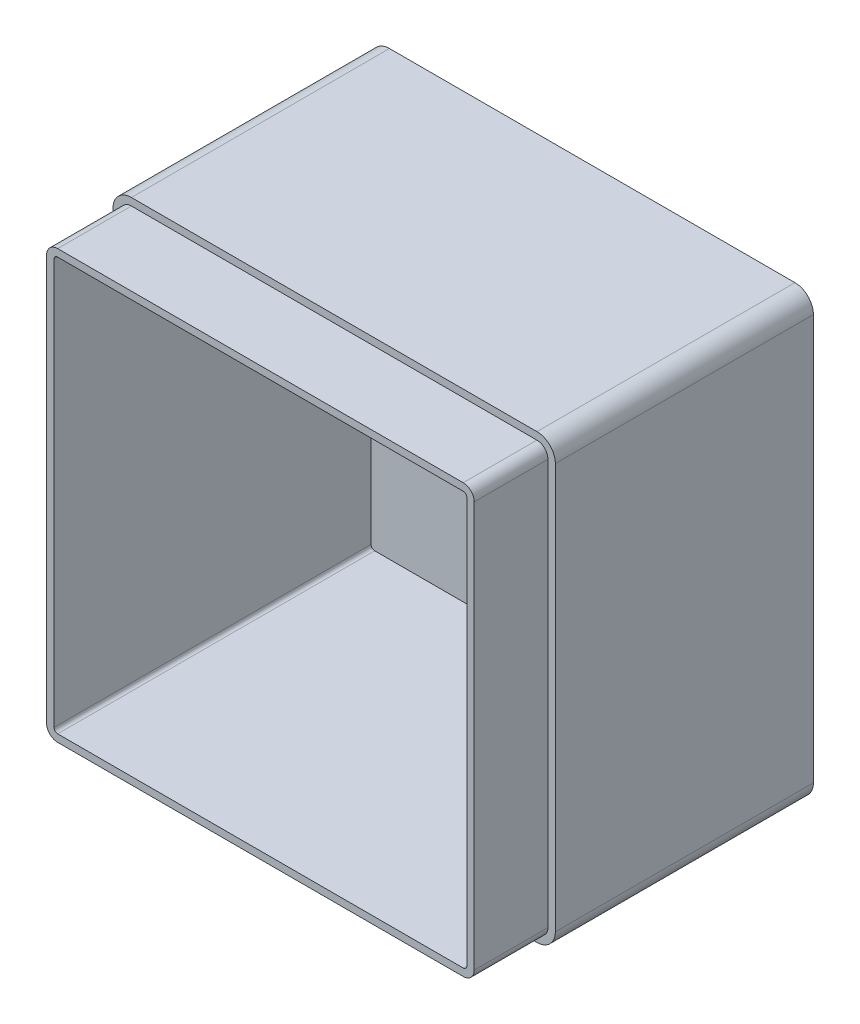
ISO-10303-21;
HEADER;
FILE_DESCRIPTION(('STEP AP214'),'2;1');
FILE_NAME('part.step','',(''),(''),'','','');
FILE_SCHEMA(('AUTOMOTIVE_DESIGN { 1 0 10303 214 1 1 1 1 }'));
ENDSEC;
DATA;
#1=APPLICATION_CONTEXT('core data for automotive mechanical design processes');
#2=APPLICATION_PROTOCOL_DEFINITION('international standard','automotive_design',2000,#1);
#3=PRODUCT_CONTEXT('',#1,'mechanical');
#4=PRODUCT('Part','Part','',(#3));
#5=PRODUCT_RELATED_PRODUCT_CATEGORY('part','',(#4));
#6=PRODUCT_DEFINITION_FORMATION('','',#4);
#7=PRODUCT_DEFINITION_CONTEXT('part definition',#1,'design');
#8=PRODUCT_DEFINITION('design','',#6,#7);
#9=PRODUCT_DEFINITION_SHAPE('','',#8);
#10=(LENGTH_UNIT() NAMED_UNIT(*) SI_UNIT(.MILLI.,.METRE.));
#11=(NAMED_UNIT(*) PLANE_ANGLE_UNIT() SI_UNIT($,.RADIAN.));
#12=(NAMED_UNIT(*) SI_UNIT($,.STERADIAN.) SOLID_ANGLE_UNIT());
#13=UNCERTAINTY_MEASURE_WITH_UNIT(LENGTH_MEASURE(1.E-05),#10,'distance_accuracy_value','');
#14=(GEOMETRIC_REPRESENTATION_CONTEXT(3) GLOBAL_UNCERTAINTY_ASSIGNED_CONTEXT((#13)) GLOBAL_UNIT_ASSIGNED_CONTEXT((#10,
#11,#12)) REPRESENTATION_CONTEXT('',''));
#15=CARTESIAN_POINT('',(0.,0.,0.));
#16=DIRECTION('',(0.,0.,1.));
#17=DIRECTION('',(1.,0.,0.));
#18=AXIS2_PLACEMENT_3D('',#15,#16,#17);
#19=CARTESIAN_POINT('',(0.,0.,90.));
#20=DIRECTION('',(0.,0.,-1.));
#21=DIRECTION('',(-1.,0.,0.));
#22=AXIS2_PLACEMENT_3D('',#19,#20,#21);
#23=PLANE('',#22);
#24=DIRECTION('',(0.,1.,0.));
#25=VECTOR('',#24,1.);
#26=CARTESIAN_POINT('',(116.,0.,90.));
#27=LINE('',#26,#25);
#28=CARTESIAN_POINT('',(116.,5.,90.));
#29=VERTEX_POINT('',#28);
#30=CARTESIAN_POINT('',(116.,115.,90.));
#31=VERTEX_POINT('',#30);
#32=EDGE_CURVE('E392',#29,#31,#27,.T.);
#33=ORIENTED_EDGE('',*,*,#32,.F.);
#34=CARTESIAN_POINT('',(115.,5.,90.));
#35=DIRECTION('',(0.,0.,-1.));
#36=DIRECTION('',(-1.,0.,0.));
#37=AXIS2_PLACEMENT_3D('',#34,#35,#36);
#38=CIRCLE('',#37,1.);
#39=CARTESIAN_POINT('',(115.,4.,90.));
#40=VERTEX_POINT('',#39);
#41=EDGE_CURVE('E389',#40,#29,#38,.F.);
#42=ORIENTED_EDGE('',*,*,#41,.F.);
#43=DIRECTION('',(1.,0.,0.));
#44=VECTOR('',#43,1.);
#45=CARTESIAN_POINT('',(0.,4.,90.));
#46=LINE('',#45,#44);
#47=CARTESIAN_POINT('',(4.99999999999999,4.,90.));
#48=VERTEX_POINT('',#47);
#49=EDGE_CURVE('E386',#48,#40,#46,.T.);
#50=ORIENTED_EDGE('',*,*,#49,.F.);
#51=CARTESIAN_POINT('',(5.,5.,90.));
#52=DIRECTION('',(0.,0.,-1.));
#53=DIRECTION('',(-1.,0.,0.));
#54=AXIS2_PLACEMENT_3D('',#51,#52,#53);
#55=CIRCLE('',#54,1.);
#56=CARTESIAN_POINT('',(4.,5.,90.));
#57=VERTEX_POINT('',#56);
#58=EDGE_CURVE('E375',#57,#48,#55,.F.);
#59=ORIENTED_EDGE('',*,*,#58,.F.);
#60=DIRECTION('',(0.,-1.,0.));
#61=VECTOR('',#60,1.);
#62=CARTESIAN_POINT('',(4.,0.,90.));
#63=LINE('',#62,#61);
#64=CARTESIAN_POINT('',(3.99999999999996,115.,90.));
#65=VERTEX_POINT('',#64);
#66=EDGE_CURVE('E339',#65,#57,#63,.T.);
#67=ORIENTED_EDGE('',*,*,#66,.F.);
#68=CARTESIAN_POINT('',(4.99999999999996,115.,90.));
#69=DIRECTION('',(0.,0.,-1.));
#70=DIRECTION('',(-1.,0.,0.));
#71=AXIS2_PLACEMENT_3D('',#68,#69,#70);
#72=CIRCLE('',#71,1.);
#73=CARTESIAN_POINT('',(4.99999999999996,116.,90.));
#74=VERTEX_POINT('',#73);
#75=EDGE_CURVE('E395',#74,#65,#72,.F.);
#76=ORIENTED_EDGE('',*,*,#75,.F.);
#77=DIRECTION('',(-1.,0.,0.));
#78=VECTOR('',#77,1.);
#79=CARTESIAN_POINT('',(0.,116.,90.));
#80=LINE('',#79,#78);
#81=CARTESIAN_POINT('',(115.,116.,90.));
#82=VERTEX_POINT('',#81);
#83=EDGE_CURVE('E382',#82,#74,#80,.T.);
#84=ORIENTED_EDGE('',*,*,#83,.F.);
#85=CARTESIAN_POINT('',(115.,115.,90.));
#86=DIRECTION('',(0.,0.,-1.));
#87=DIRECTION('',(-1.,0.,0.));
#88=AXIS2_PLACEMENT_3D('',#85,#86,#87);
#89=CIRCLE('',#88,1.);
#90=EDGE_CURVE('E334',#31,#82,#89,.F.);
#91=ORIENTED_EDGE('',*,*,#90,.F.);
#92=EDGE_LOOP('',(#33,#42,#50,#59,#67,#76,#84,#91));
#93=FACE_BOUND('',#92,.T.);
#94=CARTESIAN_POINT('',(115.,5.,90.));
#95=DIRECTION('',(0.,0.,1.));
#96=DIRECTION('',(1.,0.,0.));
#97=AXIS2_PLACEMENT_3D('',#94,#95,#96);
#98=CIRCLE('',#97,3.);
#99=CARTESIAN_POINT('',(115.,2.,90.));
#100=VERTEX_POINT('',#99);
#101=CARTESIAN_POINT('',(118.,5.,90.));
#102=VERTEX_POINT('',#101);
#103=EDGE_CURVE('E257',#100,#102,#98,.T.);
#104=ORIENTED_EDGE('',*,*,#103,.T.);
#105=DIRECTION('',(0.,1.,0.));
#106=VECTOR('',#105,1.);
#107=CARTESIAN_POINT('',(118.,5.,90.));
#108=LINE('',#107,#106);
#109=CARTESIAN_POINT('',(118.,115.,90.));
#110=VERTEX_POINT('',#109);
#111=EDGE_CURVE('E207',#102,#110,#108,.T.);
#112=ORIENTED_EDGE('',*,*,#111,.T.);
#113=CARTESIAN_POINT('',(115.,115.,90.));
#114=DIRECTION('',(0.,0.,1.));
#115=DIRECTION('',(1.,0.,0.));
#116=AXIS2_PLACEMENT_3D('',#113,#114,#115);
#117=CIRCLE('',#116,3.);
#118=CARTESIAN_POINT('',(115.,118.,90.));
#119=VERTEX_POINT('',#118);
#120=EDGE_CURVE('E55',#110,#119,#117,.T.);
#121=ORIENTED_EDGE('',*,*,#120,.T.);
#122=DIRECTION('',(-1.,0.,0.));
#123=VECTOR('',#122,1.);
#124=CARTESIAN_POINT('',(115.,118.,90.));
#125=LINE('',#124,#123);
#126=CARTESIAN_POINT('',(4.99999999999996,118.,90.));
#127=VERTEX_POINT('',#126);
#128=EDGE_CURVE('E264',#119,#127,#125,.T.);
#129=ORIENTED_EDGE('',*,*,#128,.T.);
#130=CARTESIAN_POINT('',(4.99999999999996,115.,90.));
#131=DIRECTION('',(0.,0.,1.));
#132=DIRECTION('',(1.,0.,0.));
#133=AXIS2_PLACEMENT_3D('',#130,#131,#132);
#134=CIRCLE('',#133,3.);
#135=CARTESIAN_POINT('',(1.99999999999996,115.,90.));
#136=VERTEX_POINT('',#135);
#137=EDGE_CURVE('E268',#127,#136,#134,.T.);
#138=ORIENTED_EDGE('',*,*,#137,.T.);
#139=DIRECTION('',(0.,-1.,0.));
#140=VECTOR('',#139,1.);
#141=CARTESIAN_POINT('',(1.99999999999996,115.,90.));
#142=LINE('',#141,#140);
#143=CARTESIAN_POINT('',(2.,5.,90.));
#144=VERTEX_POINT('',#143);
#145=EDGE_CURVE('E272',#136,#144,#142,.T.);
#146=ORIENTED_EDGE('',*,*,#145,.T.);
#147=CARTESIAN_POINT('',(5.,5.,90.));
#148=DIRECTION('',(0.,0.,1.));
#149=DIRECTION('',(1.,0.,0.));
#150=AXIS2_PLACEMENT_3D('',#147,#148,#149);
#151=CIRCLE('',#150,3.);
#152=CARTESIAN_POINT('',(5.,2.,90.));
#153=VERTEX_POINT('',#152);
#154=EDGE_CURVE('E234',#144,#153,#151,.T.);
#155=ORIENTED_EDGE('',*,*,#154,.T.);
#156=DIRECTION('',(1.,0.,0.));
#157=VECTOR('',#156,1.);
#158=CARTESIAN_POINT('',(5.,2.,90.));
#159=LINE('',#158,#157);
#160=EDGE_CURVE('E230',#153,#100,#159,.T.);
#161=ORIENTED_EDGE('',*,*,#160,.T.);
#162=EDGE_LOOP('',(#104,#112,#121,#129,#138,#146,#155,#161));
#163=FACE_BOUND('',#162,.T.);
#164=ADVANCED_FACE('F39',(#93,#163),#23,.F.);
#165=CARTESIAN_POINT('',(4.,0.,90.));
#166=DIRECTION('',(1.,0.,0.));
#167=DIRECTION('',(0.,1.,0.));
#168=AXIS2_PLACEMENT_3D('',#165,#166,#167);
#169=PLANE('',#168);
#170=ORIENTED_EDGE('',*,*,#66,.T.);
#171=DIRECTION('',(0.,0.,1.));
#172=VECTOR('',#171,1.);
#173=CARTESIAN_POINT('',(4.,5.,90.));
#174=LINE('',#173,#172);
#175=CARTESIAN_POINT('',(4.,5.,4.));
#176=VERTEX_POINT('',#175);
#177=EDGE_CURVE('E327',#176,#57,#174,.T.);
#178=ORIENTED_EDGE('',*,*,#177,.F.);
#179=DIRECTION('',(0.,-1.,0.));
#180=VECTOR('',#179,1.);
#181=CARTESIAN_POINT('',(4.,0.,4.));
#182=LINE('',#181,#180);
#183=CARTESIAN_POINT('',(3.99999999999996,115.,4.));
#184=VERTEX_POINT('',#183);
#185=EDGE_CURVE('E321',#184,#176,#182,.T.);
#186=ORIENTED_EDGE('',*,*,#185,.F.);
#187=DIRECTION('',(0.,0.,1.));
#188=VECTOR('',#187,1.);
#189=CARTESIAN_POINT('',(3.99999999999996,115.,90.));
#190=LINE('',#189,#188);
#191=EDGE_CURVE('E322',#65,#184,#190,.F.);
#192=ORIENTED_EDGE('',*,*,#191,.F.);
#193=EDGE_LOOP('',(#170,#178,#186,#192));
#194=FACE_BOUND('',#193,.T.);
#195=ADVANCED_FACE('F501',(#194),#169,.T.);
#196=CARTESIAN_POINT('',(0.,4.,90.));
#197=DIRECTION('',(0.,1.,0.));
#198=DIRECTION('',(0.,0.,1.));
#199=AXIS2_PLACEMENT_3D('',#196,#197,#198);
#200=PLANE('',#199);
#201=DIRECTION('',(1.,0.,0.));
#202=VECTOR('',#201,1.);
#203=CARTESIAN_POINT('',(0.,4.,4.));
#204=LINE('',#203,#202);
#205=CARTESIAN_POINT('',(4.99999999999999,4.,4.));
#206=VERTEX_POINT('',#205);
#207=CARTESIAN_POINT('',(115.,4.,4.));
#208=VERTEX_POINT('',#207);
#209=EDGE_CURVE('E331',#206,#208,#204,.T.);
#210=ORIENTED_EDGE('',*,*,#209,.F.);
#211=DIRECTION('',(0.,0.,1.));
#212=VECTOR('',#211,1.);
#213=CARTESIAN_POINT('',(4.99999999999999,4.,90.));
#214=LINE('',#213,#212);
#215=EDGE_CURVE('E326',#48,#206,#214,.F.);
#216=ORIENTED_EDGE('',*,*,#215,.F.);
#217=ORIENTED_EDGE('',*,*,#49,.T.);
#218=DIRECTION('',(0.,0.,1.));
#219=VECTOR('',#218,1.);
#220=CARTESIAN_POINT('',(115.,4.,90.));
#221=LINE('',#220,#219);
#222=EDGE_CURVE('E361',#208,#40,#221,.T.);
#223=ORIENTED_EDGE('',*,*,#222,.F.);
#224=EDGE_LOOP('',(#210,#216,#217,#223));
#225=FACE_BOUND('',#224,.T.);
#226=ADVANCED_FACE('F507',(#225),#200,.T.);
#227=CARTESIAN_POINT('',(116.,0.,90.));
#228=DIRECTION('',(-1.,0.,0.));
#229=DIRECTION('',(0.,-1.,0.));
#230=AXIS2_PLACEMENT_3D('',#227,#228,#229);
#231=PLANE('',#230);
#232=DIRECTION('',(0.,1.,0.));
#233=VECTOR('',#232,1.);
#234=CARTESIAN_POINT('',(116.,0.,4.));
#235=LINE('',#234,#233);
#236=CARTESIAN_POINT('',(116.,5.,4.));
#237=VERTEX_POINT('',#236);
#238=CARTESIAN_POINT('',(116.,115.,4.));
#239=VERTEX_POINT('',#238);
#240=EDGE_CURVE('E340',#237,#239,#235,.T.);
#241=ORIENTED_EDGE('',*,*,#240,.F.);
#242=DIRECTION('',(0.,0.,1.));
#243=VECTOR('',#242,1.);
#244=CARTESIAN_POINT('',(116.,5.,90.));
#245=LINE('',#244,#243);
#246=EDGE_CURVE('E344',#29,#237,#245,.F.);
#247=ORIENTED_EDGE('',*,*,#246,.F.);
#248=ORIENTED_EDGE('',*,*,#32,.T.);
#249=DIRECTION('',(0.,0.,1.));
#250=VECTOR('',#249,1.);
#251=CARTESIAN_POINT('',(116.,115.,90.));
#252=LINE('',#251,#250);
#253=EDGE_CURVE('E372',#239,#31,#252,.T.);
#254=ORIENTED_EDGE('',*,*,#253,.F.);
#255=EDGE_LOOP('',(#241,#247,#248,#254));
#256=FACE_BOUND('',#255,.T.);
#257=ADVANCED_FACE('F704',(#256),#231,.T.);
#258=CARTESIAN_POINT('',(0.,116.,90.));
#259=DIRECTION('',(0.,-1.,0.));
#260=DIRECTION('',(0.,0.,-1.));
#261=AXIS2_PLACEMENT_3D('',#258,#259,#260);
#262=PLANE('',#261);
#263=ORIENTED_EDGE('',*,*,#83,.T.);
#264=DIRECTION('',(0.,0.,-1.));
#265=VECTOR('',#264,1.);
#266=CARTESIAN_POINT('',(4.99999999999996,116.,90.));
#267=LINE('',#266,#265);
#268=CARTESIAN_POINT('',(4.99999999999996,116.,4.));
#269=VERTEX_POINT('',#268);
#270=EDGE_CURVE('E379',#269,#74,#267,.F.);
#271=ORIENTED_EDGE('',*,*,#270,.F.);
#272=DIRECTION('',(-1.,0.,0.));
#273=VECTOR('',#272,1.);
#274=CARTESIAN_POINT('',(0.,116.,4.));
#275=LINE('',#274,#273);
#276=CARTESIAN_POINT('',(115.,116.,4.));
#277=VERTEX_POINT('',#276);
#278=EDGE_CURVE('E335',#277,#269,#275,.T.);
#279=ORIENTED_EDGE('',*,*,#278,.F.);
#280=DIRECTION('',(0.,0.,-1.));
#281=VECTOR('',#280,1.);
#282=CARTESIAN_POINT('',(115.,116.,90.));
#283=LINE('',#282,#281);
#284=EDGE_CURVE('E358',#82,#277,#283,.T.);
#285=ORIENTED_EDGE('',*,*,#284,.F.);
#286=EDGE_LOOP('',(#263,#271,#279,#285));
#287=FACE_BOUND('',#286,.T.);
#288=ADVANCED_FACE('F694',(#287),#262,.T.);
#289=CARTESIAN_POINT('',(0.,0.,4.));
#290=DIRECTION('',(0.,0.,-1.));
#291=DIRECTION('',(-1.,0.,0.));
#292=AXIS2_PLACEMENT_3D('',#289,#290,#291);
#293=PLANE('',#292);
#294=ORIENTED_EDGE('',*,*,#278,.T.);
#295=CARTESIAN_POINT('',(4.99999999999996,115.,4.));
#296=DIRECTION('',(0.,0.,-1.));
#297=DIRECTION('',(-1.,0.,0.));
#298=AXIS2_PLACEMENT_3D('',#295,#296,#297);
#299=CIRCLE('',#298,1.);
#300=EDGE_CURVE('E345',#184,#269,#299,.T.);
#301=ORIENTED_EDGE('',*,*,#300,.F.);
#302=ORIENTED_EDGE('',*,*,#185,.T.);
#303=CARTESIAN_POINT('',(5.,5.,4.));
#304=DIRECTION('',(0.,0.,-1.));
#305=DIRECTION('',(-1.,0.,0.));
#306=AXIS2_PLACEMENT_3D('',#303,#304,#305);
#307=CIRCLE('',#306,1.);
#308=EDGE_CURVE('E352',#206,#176,#307,.T.);
#309=ORIENTED_EDGE('',*,*,#308,.F.);
#310=ORIENTED_EDGE('',*,*,#209,.T.);
#311=CARTESIAN_POINT('',(115.,5.,4.));
#312=DIRECTION('',(0.,0.,-1.));
#313=DIRECTION('',(-1.,0.,0.));
#314=AXIS2_PLACEMENT_3D('',#311,#312,#313);
#315=CIRCLE('',#314,1.);
#316=EDGE_CURVE('E349',#237,#208,#315,.T.);
#317=ORIENTED_EDGE('',*,*,#316,.F.);
#318=ORIENTED_EDGE('',*,*,#240,.T.);
#319=CARTESIAN_POINT('',(115.,115.,4.));
#320=DIRECTION('',(0.,0.,-1.));
#321=DIRECTION('',(-1.,0.,0.));
#322=AXIS2_PLACEMENT_3D('',#319,#320,#321);
#323=CIRCLE('',#322,1.);
#324=EDGE_CURVE('E341',#277,#239,#323,.T.);
#325=ORIENTED_EDGE('',*,*,#324,.F.);
#326=EDGE_LOOP('',(#294,#301,#302,#309,#310,#317,#318,#325));
#327=FACE_BOUND('',#326,.T.);
#328=ADVANCED_FACE('F684',(#327),#293,.F.);
#329=CARTESIAN_POINT('',(115.,115.,90.));
#330=DIRECTION('',(0.,0.,-1.));
#331=DIRECTION('',(-1.,0.,0.));
#332=AXIS2_PLACEMENT_3D('',#329,#330,#331);
#333=CYLINDRICAL_SURFACE('',#332,1.);
#334=ORIENTED_EDGE('',*,*,#90,.T.);
#335=ORIENTED_EDGE('',*,*,#284,.T.);
#336=ORIENTED_EDGE('',*,*,#324,.T.);
#337=ORIENTED_EDGE('',*,*,#253,.T.);
#338=EDGE_LOOP('',(#334,#335,#336,#337));
#339=FACE_BOUND('',#338,.T.);
#340=ADVANCED_FACE('F674',(#339),#333,.F.);
#341=CARTESIAN_POINT('',(4.99999999999996,115.,90.));
#342=DIRECTION('',(0.,0.,-1.));
#343=DIRECTION('',(-1.,0.,0.));
#344=AXIS2_PLACEMENT_3D('',#341,#342,#343);
#345=CYLINDRICAL_SURFACE('',#344,1.);
#346=ORIENTED_EDGE('',*,*,#75,.T.);
#347=ORIENTED_EDGE('',*,*,#191,.T.);
#348=ORIENTED_EDGE('',*,*,#300,.T.);
#349=ORIENTED_EDGE('',*,*,#270,.T.);
#350=EDGE_LOOP('',(#346,#347,#348,#349));
#351=FACE_BOUND('',#350,.T.);
#352=ADVANCED_FACE('F665',(#351),#345,.F.);
#353=CARTESIAN_POINT('',(115.,5.,90.));
#354=DIRECTION('',(0.,0.,-1.));
#355=DIRECTION('',(-1.,0.,0.));
#356=AXIS2_PLACEMENT_3D('',#353,#354,#355);
#357=CYLINDRICAL_SURFACE('',#356,1.);
#358=ORIENTED_EDGE('',*,*,#41,.T.);
#359=ORIENTED_EDGE('',*,*,#246,.T.);
#360=ORIENTED_EDGE('',*,*,#316,.T.);
#361=ORIENTED_EDGE('',*,*,#222,.T.);
#362=EDGE_LOOP('',(#358,#359,#360,#361));
#363=FACE_BOUND('',#362,.T.);
#364=ADVANCED_FACE('F656',(#363),#357,.F.);
#365=CARTESIAN_POINT('',(5.,5.,90.));
#366=DIRECTION('',(0.,0.,-1.));
#367=DIRECTION('',(-1.,0.,0.));
#368=AXIS2_PLACEMENT_3D('',#365,#366,#367);
#369=CYLINDRICAL_SURFACE('',#368,1.);
#370=ORIENTED_EDGE('',*,*,#58,.T.);
#371=ORIENTED_EDGE('',*,*,#215,.T.);
#372=ORIENTED_EDGE('',*,*,#308,.T.);
#373=ORIENTED_EDGE('',*,*,#177,.T.);
#374=EDGE_LOOP('',(#370,#371,#372,#373));
#375=FACE_BOUND('',#374,.T.);
#376=ADVANCED_FACE('F514',(#375),#369,.F.);
#377=CARTESIAN_POINT('',(115.,5.,70.));
#378=DIRECTION('',(0.,0.,1.));
#379=DIRECTION('',(1.,0.,0.));
#380=AXIS2_PLACEMENT_3D('',#377,#378,#379);
#381=PLANE('',#380);
#382=DIRECTION('',(1.,0.,0.));
#383=VECTOR('',#382,1.);
#384=CARTESIAN_POINT('',(5.,2.,70.));
#385=LINE('',#384,#383);
#386=CARTESIAN_POINT('',(5.,2.,70.));
#387=VERTEX_POINT('',#386);
#388=CARTESIAN_POINT('',(115.,2.,70.));
#389=VERTEX_POINT('',#388);
#390=EDGE_CURVE('E214',#387,#389,#385,.T.);
#391=ORIENTED_EDGE('',*,*,#390,.F.);
#392=CARTESIAN_POINT('',(5.,5.,70.));
#393=DIRECTION('',(0.,0.,1.));
#394=DIRECTION('',(1.,0.,0.));
#395=AXIS2_PLACEMENT_3D('',#392,#393,#394);
#396=CIRCLE('',#395,3.);
#397=CARTESIAN_POINT('',(2.,5.,70.));
#398=VERTEX_POINT('',#397);
#399=EDGE_CURVE('E251',#398,#387,#396,.T.);
#400=ORIENTED_EDGE('',*,*,#399,.F.);
#401=DIRECTION('',(0.,-1.,0.));
#402=VECTOR('',#401,1.);
#403=CARTESIAN_POINT('',(1.99999999999996,115.,70.));
#404=LINE('',#403,#402);
#405=CARTESIAN_POINT('',(1.99999999999996,115.,70.));
#406=VERTEX_POINT('',#405);
#407=EDGE_CURVE('E247',#406,#398,#404,.T.);
#408=ORIENTED_EDGE('',*,*,#407,.F.);
#409=CARTESIAN_POINT('',(4.99999999999996,115.,70.));
#410=DIRECTION('',(0.,0.,1.));
#411=DIRECTION('',(1.,0.,0.));
#412=AXIS2_PLACEMENT_3D('',#409,#410,#411);
#413=CIRCLE('',#412,3.);
#414=CARTESIAN_POINT('',(4.99999999999996,118.,70.));
#415=VERTEX_POINT('',#414);
#416=EDGE_CURVE('E243',#415,#406,#413,.T.);
#417=ORIENTED_EDGE('',*,*,#416,.F.);
#418=DIRECTION('',(-1.,0.,0.));
#419=VECTOR('',#418,1.);
#420=CARTESIAN_POINT('',(115.,118.,70.));
#421=LINE('',#420,#419);
#422=CARTESIAN_POINT('',(115.,118.,70.));
#423=VERTEX_POINT('',#422);
#424=EDGE_CURVE('E239',#423,#415,#421,.T.);
#425=ORIENTED_EDGE('',*,*,#424,.F.);
#426=CARTESIAN_POINT('',(115.,115.,70.));
#427=DIRECTION('',(0.,0.,1.));
#428=DIRECTION('',(1.,0.,0.));
#429=AXIS2_PLACEMENT_3D('',#426,#427,#428);
#430=CIRCLE('',#429,3.);
#431=CARTESIAN_POINT('',(118.,115.,70.));
#432=VERTEX_POINT('',#431);
#433=EDGE_CURVE('E224',#432,#423,#430,.T.);
#434=ORIENTED_EDGE('',*,*,#433,.F.);
#435=DIRECTION('',(0.,1.,0.));
#436=VECTOR('',#435,1.);
#437=CARTESIAN_POINT('',(118.,5.,70.));
#438=LINE('',#437,#436);
#439=CARTESIAN_POINT('',(118.,5.,70.));
#440=VERTEX_POINT('',#439);
#441=EDGE_CURVE('E205',#440,#432,#438,.T.);
#442=ORIENTED_EDGE('',*,*,#441,.F.);
#443=CARTESIAN_POINT('',(115.,5.,70.));
#444=DIRECTION('',(0.,0.,1.));
#445=DIRECTION('',(1.,0.,0.));
#446=AXIS2_PLACEMENT_3D('',#443,#444,#445);
#447=CIRCLE('',#446,3.);
#448=EDGE_CURVE('E220',#389,#440,#447,.T.);
#449=ORIENTED_EDGE('',*,*,#448,.F.);
#450=EDGE_LOOP('',(#391,#400,#408,#417,#425,#434,#442,#449));
#451=FACE_BOUND('',#450,.T.);
#452=CARTESIAN_POINT('',(115.,5.,70.));
#453=DIRECTION('',(0.,0.,1.));
#454=DIRECTION('',(1.,0.,0.));
#455=AXIS2_PLACEMENT_3D('',#452,#453,#454);
#456=CIRCLE('',#455,5.);
#457=CARTESIAN_POINT('',(115.,0.,70.));
#458=VERTEX_POINT('',#457);
#459=CARTESIAN_POINT('',(120.,5.,70.));
#460=VERTEX_POINT('',#459);
#461=EDGE_CURVE('E281',#458,#460,#456,.T.);
#462=ORIENTED_EDGE('',*,*,#461,.T.);
#463=DIRECTION('',(0.,1.,0.));
#464=VECTOR('',#463,1.);
#465=CARTESIAN_POINT('',(120.,5.,70.));
#466=LINE('',#465,#464);
#467=CARTESIAN_POINT('',(120.,115.,70.));
#468=VERTEX_POINT('',#467);
#469=EDGE_CURVE('E301',#460,#468,#466,.T.);
#470=ORIENTED_EDGE('',*,*,#469,.T.);
#471=CARTESIAN_POINT('',(115.,115.,70.));
#472=DIRECTION('',(0.,0.,1.));
#473=DIRECTION('',(1.,0.,0.));
#474=AXIS2_PLACEMENT_3D('',#471,#472,#473);
#475=CIRCLE('',#474,5.);
#476=CARTESIAN_POINT('',(115.,120.,70.));
#477=VERTEX_POINT('',#476);
#478=EDGE_CURVE('E304',#468,#477,#475,.T.);
#479=ORIENTED_EDGE('',*,*,#478,.T.);
#480=DIRECTION('',(-1.,0.,0.));
#481=VECTOR('',#480,1.);
#482=CARTESIAN_POINT('',(115.,120.,70.));
#483=LINE('',#482,#481);
#484=CARTESIAN_POINT('',(4.99999999999996,120.,70.));
#485=VERTEX_POINT('',#484);
#486=EDGE_CURVE('E307',#477,#485,#483,.T.);
#487=ORIENTED_EDGE('',*,*,#486,.T.);
#488=CARTESIAN_POINT('',(4.99999999999996,115.,70.));
#489=DIRECTION('',(0.,0.,1.));
#490=DIRECTION('',(1.,0.,0.));
#491=AXIS2_PLACEMENT_3D('',#488,#489,#490);
#492=CIRCLE('',#491,5.);
#493=CARTESIAN_POINT('',(0.,115.,70.));
#494=VERTEX_POINT('',#493);
#495=EDGE_CURVE('E310',#485,#494,#492,.T.);
#496=ORIENTED_EDGE('',*,*,#495,.T.);
#497=DIRECTION('',(0.,-1.,0.));
#498=VECTOR('',#497,1.);
#499=CARTESIAN_POINT('',(0.,115.,70.));
#500=LINE('',#499,#498);
#501=CARTESIAN_POINT('',(0.,5.,70.));
#502=VERTEX_POINT('',#501);
#503=EDGE_CURVE('E63',#494,#502,#500,.T.);
#504=ORIENTED_EDGE('',*,*,#503,.T.);
#505=CARTESIAN_POINT('',(5.,5.,70.));
#506=DIRECTION('',(0.,0.,1.));
#507=DIRECTION('',(1.,0.,0.));
#508=AXIS2_PLACEMENT_3D('',#505,#506,#507);
#509=CIRCLE('',#508,5.);
#510=CARTESIAN_POINT('',(5.,0.,70.));
#511=VERTEX_POINT('',#510);
#512=EDGE_CURVE('E315',#502,#511,#509,.T.);
#513=ORIENTED_EDGE('',*,*,#512,.T.);
#514=DIRECTION('',(1.,0.,0.));
#515=VECTOR('',#514,1.);
#516=CARTESIAN_POINT('',(5.,0.,70.));
#517=LINE('',#516,#515);
#518=EDGE_CURVE('E318',#511,#458,#517,.T.);
#519=ORIENTED_EDGE('',*,*,#518,.T.);
#520=EDGE_LOOP('',(#462,#470,#479,#487,#496,#504,#513,#519));
#521=FACE_BOUND('',#520,.T.);
#522=ADVANCED_FACE('F219',(#451,#521),#381,.T.);
#523=CARTESIAN_POINT('',(115.,5.,70.));
#524=DIRECTION('',(0.,0.,1.));
#525=DIRECTION('',(1.,0.,0.));
#526=AXIS2_PLACEMENT_3D('',#523,#524,#525);
#527=CYLINDRICAL_SURFACE('',#526,3.);
#528=ORIENTED_EDGE('',*,*,#103,.F.);
#529=DIRECTION('',(0.,0.,1.));
#530=VECTOR('',#529,1.);
#531=CARTESIAN_POINT('',(115.,2.,70.));
#532=LINE('',#531,#530);
#533=EDGE_CURVE('E228',#389,#100,#532,.T.);
#534=ORIENTED_EDGE('',*,*,#533,.F.);
#535=ORIENTED_EDGE('',*,*,#448,.T.);
#536=DIRECTION('',(0.,0.,1.));
#537=VECTOR('',#536,1.);
#538=CARTESIAN_POINT('',(118.,5.,70.));
#539=LINE('',#538,#537);
#540=EDGE_CURVE('E202',#440,#102,#539,.T.);
#541=ORIENTED_EDGE('',*,*,#540,.T.);
#542=EDGE_LOOP('',(#528,#534,#535,#541));
#543=FACE_BOUND('',#542,.T.);
#544=ADVANCED_FACE('F227',(#543),#527,.T.);
#545=CARTESIAN_POINT('',(5.,2.,70.));
#546=DIRECTION('',(0.,-1.,0.));
#547=DIRECTION('',(0.,0.,-1.));
#548=AXIS2_PLACEMENT_3D('',#545,#546,#547);
#549=PLANE('',#548);
#550=ORIENTED_EDGE('',*,*,#160,.F.);
#551=DIRECTION('',(0.,0.,1.));
#552=VECTOR('',#551,1.);
#553=CARTESIAN_POINT('',(5.,2.,70.));
#554=LINE('',#553,#552);
#555=EDGE_CURVE('E282',#387,#153,#554,.T.);
#556=ORIENTED_EDGE('',*,*,#555,.F.);
#557=ORIENTED_EDGE('',*,*,#390,.T.);
#558=ORIENTED_EDGE('',*,*,#533,.T.);
#559=EDGE_LOOP('',(#550,#556,#557,#558));
#560=FACE_BOUND('',#559,.T.);
#561=ADVANCED_FACE('F582',(#560),#549,.T.);
#562=CARTESIAN_POINT('',(5.,5.,70.));
#563=DIRECTION('',(0.,0.,1.));
#564=DIRECTION('',(1.,0.,0.));
#565=AXIS2_PLACEMENT_3D('',#562,#563,#564);
#566=CYLINDRICAL_SURFACE('',#565,3.);
#567=ORIENTED_EDGE('',*,*,#154,.F.);
#568=DIRECTION('',(0.,0.,1.));
#569=VECTOR('',#568,1.);
#570=CARTESIAN_POINT('',(2.,5.,70.));
#571=LINE('',#570,#569);
#572=EDGE_CURVE('E285',#398,#144,#571,.T.);
#573=ORIENTED_EDGE('',*,*,#572,.F.);
#574=ORIENTED_EDGE('',*,*,#399,.T.);
#575=ORIENTED_EDGE('',*,*,#555,.T.);
#576=EDGE_LOOP('',(#567,#573,#574,#575));
#577=FACE_BOUND('',#576,.T.);
#578=ADVANCED_FACE('F590',(#577),#566,.T.);
#579=CARTESIAN_POINT('',(1.99999999999996,115.,70.));
#580=DIRECTION('',(-1.,0.,0.));
#581=DIRECTION('',(0.,-1.,0.));
#582=AXIS2_PLACEMENT_3D('',#579,#580,#581);
#583=PLANE('',#582);
#584=ORIENTED_EDGE('',*,*,#145,.F.);
#585=DIRECTION('',(0.,0.,1.));
#586=VECTOR('',#585,1.);
#587=CARTESIAN_POINT('',(1.99999999999996,115.,70.));
#588=LINE('',#587,#586);
#589=EDGE_CURVE('E288',#406,#136,#588,.T.);
#590=ORIENTED_EDGE('',*,*,#589,.F.);
#591=ORIENTED_EDGE('',*,*,#407,.T.);
#592=ORIENTED_EDGE('',*,*,#572,.T.);
#593=EDGE_LOOP('',(#584,#590,#591,#592));
#594=FACE_BOUND('',#593,.T.);
#595=ADVANCED_FACE('F599',(#594),#583,.T.);
#596=CARTESIAN_POINT('',(4.99999999999996,115.,70.));
#597=DIRECTION('',(0.,0.,1.));
#598=DIRECTION('',(1.,0.,0.));
#599=AXIS2_PLACEMENT_3D('',#596,#597,#598);
#600=CYLINDRICAL_SURFACE('',#599,3.);
#601=ORIENTED_EDGE('',*,*,#137,.F.);
#602=DIRECTION('',(0.,0.,1.));
#603=VECTOR('',#602,1.);
#604=CARTESIAN_POINT('',(4.99999999999996,118.,70.));
#605=LINE('',#604,#603);
#606=EDGE_CURVE('E291',#415,#127,#605,.T.);
#607=ORIENTED_EDGE('',*,*,#606,.F.);
#608=ORIENTED_EDGE('',*,*,#416,.T.);
#609=ORIENTED_EDGE('',*,*,#589,.T.);
#610=EDGE_LOOP('',(#601,#607,#608,#609));
#611=FACE_BOUND('',#610,.T.);
#612=ADVANCED_FACE('F608',(#611),#600,.T.);
#613=CARTESIAN_POINT('',(115.,118.,70.));
#614=DIRECTION('',(0.,1.,0.));
#615=DIRECTION('',(0.,0.,1.));
#616=AXIS2_PLACEMENT_3D('',#613,#614,#615);
#617=PLANE('',#616);
#618=ORIENTED_EDGE('',*,*,#128,.F.);
#619=DIRECTION('',(0.,0.,1.));
#620=VECTOR('',#619,1.);
#621=CARTESIAN_POINT('',(115.,118.,70.));
#622=LINE('',#621,#620);
#623=EDGE_CURVE('E294',#423,#119,#622,.T.);
#624=ORIENTED_EDGE('',*,*,#623,.F.);
#625=ORIENTED_EDGE('',*,*,#424,.T.);
#626=ORIENTED_EDGE('',*,*,#606,.T.);
#627=EDGE_LOOP('',(#618,#624,#625,#626));
#628=FACE_BOUND('',#627,.T.);
#629=ADVANCED_FACE('F617',(#628),#617,.T.);
#630=CARTESIAN_POINT('',(115.,115.,70.));
#631=DIRECTION('',(0.,0.,1.));
#632=DIRECTION('',(1.,0.,0.));
#633=AXIS2_PLACEMENT_3D('',#630,#631,#632);
#634=CYLINDRICAL_SURFACE('',#633,3.);
#635=ORIENTED_EDGE('',*,*,#120,.F.);
#636=DIRECTION('',(0.,0.,1.));
#637=VECTOR('',#636,1.);
#638=CARTESIAN_POINT('',(118.,115.,70.));
#639=LINE('',#638,#637);
#640=EDGE_CURVE('E213',#432,#110,#639,.T.);
#641=ORIENTED_EDGE('',*,*,#640,.F.);
#642=ORIENTED_EDGE('',*,*,#433,.T.);
#643=ORIENTED_EDGE('',*,*,#623,.T.);
#644=EDGE_LOOP('',(#635,#641,#642,#643));
#645=FACE_BOUND('',#644,.T.);
#646=ADVANCED_FACE('F626',(#645),#634,.T.);
#647=CARTESIAN_POINT('',(118.,5.,70.));
#648=DIRECTION('',(1.,0.,0.));
#649=DIRECTION('',(0.,1.,0.));
#650=AXIS2_PLACEMENT_3D('',#647,#648,#649);
#651=PLANE('',#650);
#652=ORIENTED_EDGE('',*,*,#111,.F.);
#653=ORIENTED_EDGE('',*,*,#540,.F.);
#654=ORIENTED_EDGE('',*,*,#441,.T.);
#655=ORIENTED_EDGE('',*,*,#640,.T.);
#656=EDGE_LOOP('',(#652,#653,#654,#655));
#657=FACE_BOUND('',#656,.T.);
#658=ADVANCED_FACE('F204',(#657),#651,.T.);
#659=CARTESIAN_POINT('',(0.,0.,0.));
#660=DIRECTION('',(0.,0.,-1.));
#661=DIRECTION('',(-1.,0.,0.));
#662=AXIS2_PLACEMENT_3D('',#659,#660,#661);
#663=PLANE('',#662);
#664=DIRECTION('',(-1.,0.,0.));
#665=VECTOR('',#664,1.);
#666=CARTESIAN_POINT('',(0.,120.,0.));
#667=LINE('',#666,#665);
#668=CARTESIAN_POINT('',(115.,120.,0.));
#669=VERTEX_POINT('',#668);
#670=CARTESIAN_POINT('',(4.99999999999996,120.,0.));
#671=VERTEX_POINT('',#670);
#672=EDGE_CURVE('E417',#669,#671,#667,.T.);
#673=ORIENTED_EDGE('',*,*,#672,.F.);
#674=CARTESIAN_POINT('',(115.,115.,0.));
#675=DIRECTION('',(0.,0.,-1.));
#676=DIRECTION('',(-1.,0.,0.));
#677=AXIS2_PLACEMENT_3D('',#674,#675,#676);
#678=CIRCLE('',#677,5.);
#679=CARTESIAN_POINT('',(120.,115.,0.));
#680=VERTEX_POINT('',#679);
#681=EDGE_CURVE('E437',#669,#680,#678,.T.);
#682=ORIENTED_EDGE('',*,*,#681,.T.);
#683=DIRECTION('',(0.,1.,0.));
#684=VECTOR('',#683,1.);
#685=CARTESIAN_POINT('',(120.,0.,0.));
#686=LINE('',#685,#684);
#687=CARTESIAN_POINT('',(120.,5.,0.));
#688=VERTEX_POINT('',#687);
#689=EDGE_CURVE('E413',#688,#680,#686,.T.);
#690=ORIENTED_EDGE('',*,*,#689,.F.);
#691=CARTESIAN_POINT('',(115.,5.,0.));
#692=DIRECTION('',(0.,0.,-1.));
#693=DIRECTION('',(-1.,0.,0.));
#694=AXIS2_PLACEMENT_3D('',#691,#692,#693);
#695=CIRCLE('',#694,5.);
#696=CARTESIAN_POINT('',(115.,0.,0.));
#697=VERTEX_POINT('',#696);
#698=EDGE_CURVE('E431',#688,#697,#695,.T.);
#699=ORIENTED_EDGE('',*,*,#698,.T.);
#700=DIRECTION('',(1.,0.,0.));
#701=VECTOR('',#700,1.);
#702=CARTESIAN_POINT('',(0.,0.,0.));
#703=LINE('',#702,#701);
#704=CARTESIAN_POINT('',(5.,0.,0.));
#705=VERTEX_POINT('',#704);
#706=EDGE_CURVE('E409',#705,#697,#703,.T.);
#707=ORIENTED_EDGE('',*,*,#706,.F.);
#708=CARTESIAN_POINT('',(5.,5.,0.));
#709=DIRECTION('',(0.,0.,-1.));
#710=DIRECTION('',(-1.,0.,0.));
#711=AXIS2_PLACEMENT_3D('',#708,#709,#710);
#712=CIRCLE('',#711,5.);
#713=CARTESIAN_POINT('',(0.,5.,0.));
#714=VERTEX_POINT('',#713);
#715=EDGE_CURVE('E428',#705,#714,#712,.T.);
#716=ORIENTED_EDGE('',*,*,#715,.T.);
#717=DIRECTION('',(0.,-1.,0.));
#718=VECTOR('',#717,1.);
#719=CARTESIAN_POINT('',(0.,0.,0.));
#720=LINE('',#719,#718);
#721=CARTESIAN_POINT('',(0.,115.,0.));
#722=VERTEX_POINT('',#721);
#723=EDGE_CURVE('E365',#722,#714,#720,.T.);
#724=ORIENTED_EDGE('',*,*,#723,.F.);
#725=CARTESIAN_POINT('',(4.99999999999996,115.,0.));
#726=DIRECTION('',(0.,0.,-1.));
#727=DIRECTION('',(-1.,0.,0.));
#728=AXIS2_PLACEMENT_3D('',#725,#726,#727);
#729=CIRCLE('',#728,5.);
#730=EDGE_CURVE('E434',#722,#671,#729,.T.);
#731=ORIENTED_EDGE('',*,*,#730,.T.);
#732=EDGE_LOOP('',(#673,#682,#690,#699,#707,#716,#724,#731));
#733=FACE_BOUND('',#732,.T.);
#734=ADVANCED_FACE('F466',(#733),#663,.T.);
#735=CARTESIAN_POINT('',(4.99999999999996,115.,90.));
#736=DIRECTION('',(0.,0.,-1.));
#737=DIRECTION('',(-1.,0.,0.));
#738=AXIS2_PLACEMENT_3D('',#735,#736,#737);
#739=CYLINDRICAL_SURFACE('',#738,5.);
#740=DIRECTION('',(0.,0.,-1.));
#741=VECTOR('',#740,1.);
#742=CARTESIAN_POINT('',(0.,115.,90.));
#743=LINE('',#742,#741);
#744=EDGE_CURVE('E451',#494,#722,#743,.T.);
#745=ORIENTED_EDGE('',*,*,#744,.F.);
#746=ORIENTED_EDGE('',*,*,#495,.F.);
#747=DIRECTION('',(0.,0.,-1.));
#748=VECTOR('',#747,1.);
#749=CARTESIAN_POINT('',(4.99999999999996,120.,90.));
#750=LINE('',#749,#748);
#751=EDGE_CURVE('E421',#671,#485,#750,.F.);
#752=ORIENTED_EDGE('',*,*,#751,.F.);
#753=ORIENTED_EDGE('',*,*,#730,.F.);
#754=EDGE_LOOP('',(#745,#746,#752,#753));
#755=FACE_BOUND('',#754,.T.);
#756=ADVANCED_FACE('F490',(#755),#739,.T.);
#757=CARTESIAN_POINT('',(115.,115.,90.));
#758=DIRECTION('',(0.,0.,-1.));
#759=DIRECTION('',(-1.,0.,0.));
#760=AXIS2_PLACEMENT_3D('',#757,#758,#759);
#761=CYLINDRICAL_SURFACE('',#760,5.);
#762=DIRECTION('',(0.,0.,-1.));
#763=VECTOR('',#762,1.);
#764=CARTESIAN_POINT('',(115.,120.,90.));
#765=LINE('',#764,#763);
#766=EDGE_CURVE('E425',#477,#669,#765,.T.);
#767=ORIENTED_EDGE('',*,*,#766,.F.);
#768=ORIENTED_EDGE('',*,*,#478,.F.);
#769=DIRECTION('',(0.,0.,-1.));
#770=VECTOR('',#769,1.);
#771=CARTESIAN_POINT('',(120.,115.,90.));
#772=LINE('',#771,#770);
#773=EDGE_CURVE('E443',#680,#468,#772,.F.);
#774=ORIENTED_EDGE('',*,*,#773,.F.);
#775=ORIENTED_EDGE('',*,*,#681,.F.);
#776=EDGE_LOOP('',(#767,#768,#774,#775));
#777=FACE_BOUND('',#776,.T.);
#778=ADVANCED_FACE('F481',(#777),#761,.T.);
#779=CARTESIAN_POINT('',(0.,120.,90.));
#780=DIRECTION('',(0.,-1.,0.));
#781=DIRECTION('',(0.,0.,-1.));
#782=AXIS2_PLACEMENT_3D('',#779,#780,#781);
#783=PLANE('',#782);
#784=ORIENTED_EDGE('',*,*,#486,.F.);
#785=ORIENTED_EDGE('',*,*,#766,.T.);
#786=ORIENTED_EDGE('',*,*,#672,.T.);
#787=ORIENTED_EDGE('',*,*,#751,.T.);
#788=EDGE_LOOP('',(#784,#785,#786,#787));
#789=FACE_BOUND('',#788,.T.);
#790=ADVANCED_FACE('F485',(#789),#783,.F.);
#791=CARTESIAN_POINT('',(115.,5.,90.));
#792=DIRECTION('',(0.,0.,-1.));
#793=DIRECTION('',(-1.,0.,0.));
#794=AXIS2_PLACEMENT_3D('',#791,#792,#793);
#795=CYLINDRICAL_SURFACE('',#794,5.);
#796=DIRECTION('',(0.,0.,-1.));
#797=VECTOR('',#796,1.);
#798=CARTESIAN_POINT('',(120.,5.,90.));
#799=LINE('',#798,#797);
#800=EDGE_CURVE('E440',#460,#688,#799,.T.);
#801=ORIENTED_EDGE('',*,*,#800,.F.);
#802=ORIENTED_EDGE('',*,*,#461,.F.);
#803=DIRECTION('',(0.,0.,-1.));
#804=VECTOR('',#803,1.);
#805=CARTESIAN_POINT('',(115.,0.,90.));
#806=LINE('',#805,#804);
#807=EDGE_CURVE('E11',#697,#458,#806,.F.);
#808=ORIENTED_EDGE('',*,*,#807,.F.);
#809=ORIENTED_EDGE('',*,*,#698,.F.);
#810=EDGE_LOOP('',(#801,#802,#808,#809));
#811=FACE_BOUND('',#810,.T.);
#812=ADVANCED_FACE('F471',(#811),#795,.T.);
#813=CARTESIAN_POINT('',(120.,0.,90.));
#814=DIRECTION('',(-1.,0.,0.));
#815=DIRECTION('',(0.,-1.,0.));
#816=AXIS2_PLACEMENT_3D('',#813,#814,#815);
#817=PLANE('',#816);
#818=ORIENTED_EDGE('',*,*,#469,.F.);
#819=ORIENTED_EDGE('',*,*,#800,.T.);
#820=ORIENTED_EDGE('',*,*,#689,.T.);
#821=ORIENTED_EDGE('',*,*,#773,.T.);
#822=EDGE_LOOP('',(#818,#819,#820,#821));
#823=FACE_BOUND('',#822,.T.);
#824=ADVANCED_FACE('F476',(#823),#817,.F.);
#825=CARTESIAN_POINT('',(5.,5.,90.));
#826=DIRECTION('',(0.,0.,-1.));
#827=DIRECTION('',(-1.,0.,0.));
#828=AXIS2_PLACEMENT_3D('',#825,#826,#827);
#829=CYLINDRICAL_SURFACE('',#828,5.);
#830=DIRECTION('',(0.,0.,-1.));
#831=VECTOR('',#830,1.);
#832=CARTESIAN_POINT('',(5.,0.,90.));
#833=LINE('',#832,#831);
#834=EDGE_CURVE('E48',#511,#705,#833,.T.);
#835=ORIENTED_EDGE('',*,*,#834,.F.);
#836=ORIENTED_EDGE('',*,*,#512,.F.);
#837=DIRECTION('',(0.,0.,-1.));
#838=VECTOR('',#837,1.);
#839=CARTESIAN_POINT('',(0.,5.,90.));
#840=LINE('',#839,#838);
#841=EDGE_CURVE('E447',#714,#502,#840,.F.);
#842=ORIENTED_EDGE('',*,*,#841,.F.);
#843=ORIENTED_EDGE('',*,*,#715,.F.);
#844=EDGE_LOOP('',(#835,#836,#842,#843));
#845=FACE_BOUND('',#844,.T.);
#846=ADVANCED_FACE('F41',(#845),#829,.T.);
#847=CARTESIAN_POINT('',(0.,0.,90.));
#848=DIRECTION('',(0.,1.,0.));
#849=DIRECTION('',(0.,0.,1.));
#850=AXIS2_PLACEMENT_3D('',#847,#848,#849);
#851=PLANE('',#850);
#852=ORIENTED_EDGE('',*,*,#518,.F.);
#853=ORIENTED_EDGE('',*,*,#834,.T.);
#854=ORIENTED_EDGE('',*,*,#706,.T.);
#855=ORIENTED_EDGE('',*,*,#807,.T.);
#856=EDGE_LOOP('',(#852,#853,#854,#855));
#857=FACE_BOUND('',#856,.T.);
#858=ADVANCED_FACE('F458',(#857),#851,.F.);
#859=CARTESIAN_POINT('',(0.,0.,90.));
#860=DIRECTION('',(1.,0.,0.));
#861=DIRECTION('',(0.,1.,0.));
#862=AXIS2_PLACEMENT_3D('',#859,#860,#861);
#863=PLANE('',#862);
#864=ORIENTED_EDGE('',*,*,#503,.F.);
#865=ORIENTED_EDGE('',*,*,#744,.T.);
#866=ORIENTED_EDGE('',*,*,#723,.T.);
#867=ORIENTED_EDGE('',*,*,#841,.T.);
#868=EDGE_LOOP('',(#864,#865,#866,#867));
#869=FACE_BOUND('',#868,.T.);
#870=ADVANCED_FACE('F492',(#869),#863,.F.);
#871=CLOSED_SHELL('',(#164,#195,#226,#257,#288,#328,#340,#352,#364,#376,#522,#544,#561,#578,
#595,#612,#629,#646,#658,#734,#756,#778,#790,#812,#824,#846,#858,#870));
#872=MANIFOLD_SOLID_BREP('B2',#871);
#873=ADVANCED_BREP_SHAPE_REPRESENTATION('',(#18,#872),#14);
#874=SHAPE_DEFINITION_REPRESENTATION(#9,#873);
ENDSEC;
END-ISO-10303-21;
